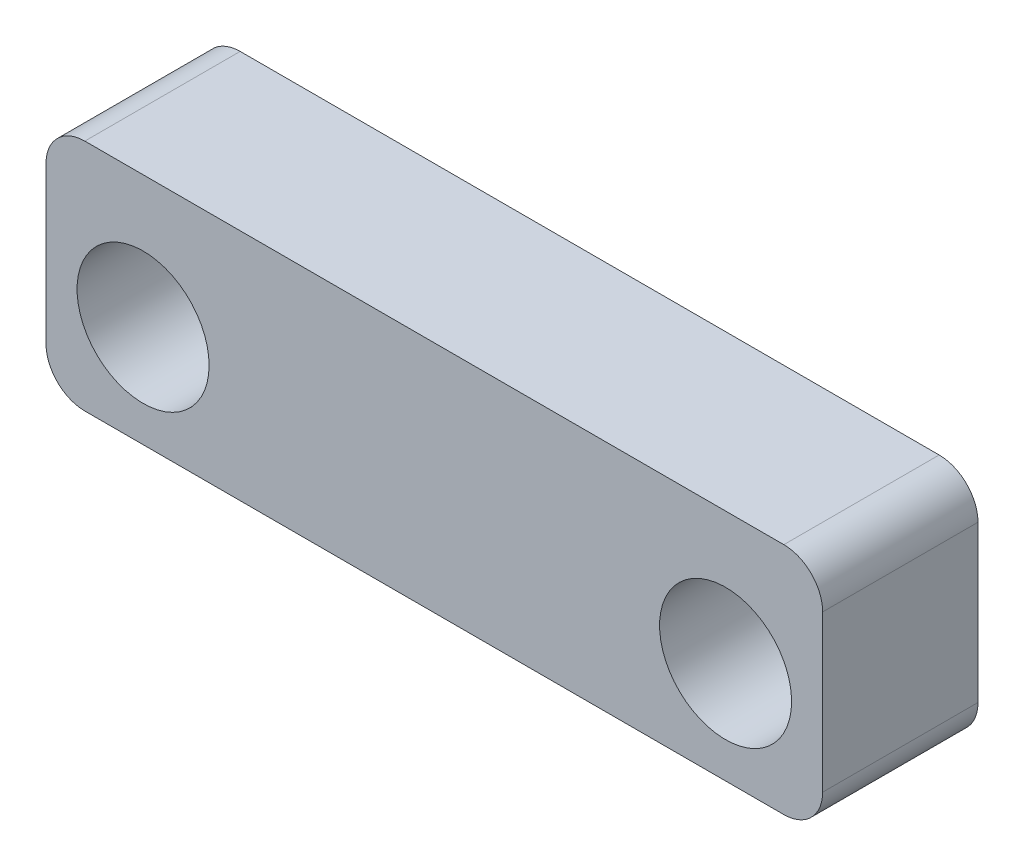
ISO-10303-21;
HEADER;
FILE_DESCRIPTION(('STEP AP214'),'2;1');
FILE_NAME('part.step','',(''),(''),'','','');
FILE_SCHEMA(('AUTOMOTIVE_DESIGN { 1 0 10303 214 1 1 1 1 }'));
ENDSEC;
DATA;
#1=APPLICATION_CONTEXT('core data for automotive mechanical design processes');
#2=APPLICATION_PROTOCOL_DEFINITION('international standard','automotive_design',2000,#1);
#3=PRODUCT_CONTEXT('',#1,'mechanical');
#4=PRODUCT('Part','Part','',(#3));
#5=PRODUCT_RELATED_PRODUCT_CATEGORY('part','',(#4));
#6=PRODUCT_DEFINITION_FORMATION('','',#4);
#7=PRODUCT_DEFINITION_CONTEXT('part definition',#1,'design');
#8=PRODUCT_DEFINITION('design','',#6,#7);
#9=PRODUCT_DEFINITION_SHAPE('','',#8);
#10=(LENGTH_UNIT() NAMED_UNIT(*) SI_UNIT(.MILLI.,.METRE.));
#11=(NAMED_UNIT(*) PLANE_ANGLE_UNIT() SI_UNIT($,.RADIAN.));
#12=(NAMED_UNIT(*) SI_UNIT($,.STERADIAN.) SOLID_ANGLE_UNIT());
#13=UNCERTAINTY_MEASURE_WITH_UNIT(LENGTH_MEASURE(1.E-05),#10,'distance_accuracy_value','');
#14=(GEOMETRIC_REPRESENTATION_CONTEXT(3) GLOBAL_UNCERTAINTY_ASSIGNED_CONTEXT((#13)) GLOBAL_UNIT_ASSIGNED_CONTEXT((#10,
#11,#12)) REPRESENTATION_CONTEXT('',''));
#15=CARTESIAN_POINT('',(0.,0.,0.));
#16=DIRECTION('',(0.,0.,1.));
#17=DIRECTION('',(1.,0.,0.));
#18=AXIS2_PLACEMENT_3D('',#15,#16,#17);
#19=CARTESIAN_POINT('',(-31.3276457282223,41.1785182435217,137.365661293432));
#20=DIRECTION('',(1.,0.,0.));
#21=DIRECTION('',(0.,0.,-1.));
#22=AXIS2_PLACEMENT_3D('',#19,#20,#21);
#23=PLANE('',#22);
#24=DIRECTION('',(0.,-1.,0.));
#25=VECTOR('',#24,1.);
#26=CARTESIAN_POINT('',(-31.3276457282223,41.1785182435217,133.365661293432));
#27=LINE('',#26,#25);
#28=CARTESIAN_POINT('',(-31.3276457282223,40.1785182435217,133.365661293432));
#29=VERTEX_POINT('',#28);
#30=CARTESIAN_POINT('',(-31.3276457282223,36.1582393508905,133.365661293432));
#31=VERTEX_POINT('',#30);
#32=EDGE_CURVE('E131',#29,#31,#27,.T.);
#33=ORIENTED_EDGE('',*,*,#32,.T.);
#34=DIRECTION('',(0.,0.,-1.));
#35=VECTOR('',#34,1.);
#36=CARTESIAN_POINT('',(-31.3276457282223,36.1582393508905,137.365661293432));
#37=LINE('',#36,#35);
#38=CARTESIAN_POINT('',(-31.3276457282223,36.1582393508905,137.365661293432));
#39=VERTEX_POINT('',#38);
#40=EDGE_CURVE('E11',#31,#39,#37,.F.);
#41=ORIENTED_EDGE('',*,*,#40,.T.);
#42=DIRECTION('',(0.,-1.,0.));
#43=VECTOR('',#42,1.);
#44=CARTESIAN_POINT('',(-31.3276457282223,41.1785182435217,137.365661293432));
#45=LINE('',#44,#43);
#46=CARTESIAN_POINT('',(-31.3276457282223,40.1785182435217,137.365661293432));
#47=VERTEX_POINT('',#46);
#48=EDGE_CURVE('E129',#47,#39,#45,.T.);
#49=ORIENTED_EDGE('',*,*,#48,.F.);
#50=DIRECTION('',(0.,0.,-1.));
#51=VECTOR('',#50,1.);
#52=CARTESIAN_POINT('',(-31.3276457282223,40.1785182435217,137.365661293432));
#53=LINE('',#52,#51);
#54=EDGE_CURVE('E42',#47,#29,#53,.T.);
#55=ORIENTED_EDGE('',*,*,#54,.T.);
#56=EDGE_LOOP('',(#33,#41,#49,#55));
#57=FACE_BOUND('',#56,.T.);
#58=ADVANCED_FACE('F33',(#57),#23,.F.);
#59=CARTESIAN_POINT('',(-31.3276457282223,35.1582393508905,137.365661293432));
#60=DIRECTION('',(0.,1.,0.));
#61=DIRECTION('',(0.,0.,1.));
#62=AXIS2_PLACEMENT_3D('',#59,#60,#61);
#63=PLANE('',#62);
#64=DIRECTION('',(1.,0.,0.));
#65=VECTOR('',#64,1.);
#66=CARTESIAN_POINT('',(-31.3276457282223,35.1582393508905,133.365661293432));
#67=LINE('',#66,#65);
#68=CARTESIAN_POINT('',(-30.3276457282223,35.1582393508905,133.365661293432));
#69=VERTEX_POINT('',#68);
#70=CARTESIAN_POINT('',(-12.3276457282223,35.1582393508905,133.365661293432));
#71=VERTEX_POINT('',#70);
#72=EDGE_CURVE('E127',#69,#71,#67,.T.);
#73=ORIENTED_EDGE('',*,*,#72,.T.);
#74=DIRECTION('',(0.,0.,-1.));
#75=VECTOR('',#74,1.);
#76=CARTESIAN_POINT('',(-12.3276457282223,35.1582393508905,137.365661293432));
#77=LINE('',#76,#75);
#78=CARTESIAN_POINT('',(-12.3276457282223,35.1582393508905,137.365661293432));
#79=VERTEX_POINT('',#78);
#80=EDGE_CURVE('E106',#71,#79,#77,.F.);
#81=ORIENTED_EDGE('',*,*,#80,.T.);
#82=DIRECTION('',(1.,0.,0.));
#83=VECTOR('',#82,1.);
#84=CARTESIAN_POINT('',(-31.3276457282223,35.1582393508905,137.365661293432));
#85=LINE('',#84,#83);
#86=CARTESIAN_POINT('',(-30.3276457282223,35.1582393508905,137.365661293432));
#87=VERTEX_POINT('',#86);
#88=EDGE_CURVE('E172',#87,#79,#85,.T.);
#89=ORIENTED_EDGE('',*,*,#88,.F.);
#90=DIRECTION('',(0.,0.,-1.));
#91=VECTOR('',#90,1.);
#92=CARTESIAN_POINT('',(-30.3276457282223,35.1582393508905,137.365661293432));
#93=LINE('',#92,#91);
#94=EDGE_CURVE('E111',#87,#69,#93,.T.);
#95=ORIENTED_EDGE('',*,*,#94,.T.);
#96=EDGE_LOOP('',(#73,#81,#89,#95));
#97=FACE_BOUND('',#96,.T.);
#98=ADVANCED_FACE('F191',(#97),#63,.F.);
#99=CARTESIAN_POINT('',(-11.3276457282223,41.1785182435217,137.365661293432));
#100=DIRECTION('',(-1.,0.,0.));
#101=DIRECTION('',(0.,0.,1.));
#102=AXIS2_PLACEMENT_3D('',#99,#100,#101);
#103=PLANE('',#102);
#104=DIRECTION('',(0.,1.,0.));
#105=VECTOR('',#104,1.);
#106=CARTESIAN_POINT('',(-11.3276457282223,41.1785182435217,137.365661293432));
#107=LINE('',#106,#105);
#108=CARTESIAN_POINT('',(-11.3276457282223,36.1582393508905,137.365661293432));
#109=VERTEX_POINT('',#108);
#110=CARTESIAN_POINT('',(-11.3276457282223,40.1785182435217,137.365661293432));
#111=VERTEX_POINT('',#110);
#112=EDGE_CURVE('E120',#109,#111,#107,.T.);
#113=ORIENTED_EDGE('',*,*,#112,.F.);
#114=DIRECTION('',(0.,0.,-1.));
#115=VECTOR('',#114,1.);
#116=CARTESIAN_POINT('',(-11.3276457282223,36.1582393508905,137.365661293432));
#117=LINE('',#116,#115);
#118=CARTESIAN_POINT('',(-11.3276457282223,36.1582393508905,133.365661293432));
#119=VERTEX_POINT('',#118);
#120=EDGE_CURVE('E105',#109,#119,#117,.T.);
#121=ORIENTED_EDGE('',*,*,#120,.T.);
#122=DIRECTION('',(0.,1.,0.));
#123=VECTOR('',#122,1.);
#124=CARTESIAN_POINT('',(-11.3276457282223,41.1785182435217,133.365661293432));
#125=LINE('',#124,#123);
#126=CARTESIAN_POINT('',(-11.3276457282223,40.1785182435217,133.365661293432));
#127=VERTEX_POINT('',#126);
#128=EDGE_CURVE('E118',#119,#127,#125,.T.);
#129=ORIENTED_EDGE('',*,*,#128,.T.);
#130=DIRECTION('',(0.,0.,-1.));
#131=VECTOR('',#130,1.);
#132=CARTESIAN_POINT('',(-11.3276457282223,40.1785182435217,137.365661293432));
#133=LINE('',#132,#131);
#134=EDGE_CURVE('E122',#127,#111,#133,.F.);
#135=ORIENTED_EDGE('',*,*,#134,.T.);
#136=EDGE_LOOP('',(#113,#121,#129,#135));
#137=FACE_BOUND('',#136,.T.);
#138=ADVANCED_FACE('F117',(#137),#103,.F.);
#139=CARTESIAN_POINT('',(-31.3276457282223,41.1785182435217,137.365661293432));
#140=DIRECTION('',(0.,-1.,0.));
#141=DIRECTION('',(0.,0.,-1.));
#142=AXIS2_PLACEMENT_3D('',#139,#140,#141);
#143=PLANE('',#142);
#144=DIRECTION('',(-1.,0.,0.));
#145=VECTOR('',#144,1.);
#146=CARTESIAN_POINT('',(-31.3276457282223,41.1785182435217,137.365661293432));
#147=LINE('',#146,#145);
#148=CARTESIAN_POINT('',(-12.3276457282223,41.1785182435217,137.365661293432));
#149=VERTEX_POINT('',#148);
#150=CARTESIAN_POINT('',(-30.3276457282223,41.1785182435217,137.365661293432));
#151=VERTEX_POINT('',#150);
#152=EDGE_CURVE('E135',#149,#151,#147,.T.);
#153=ORIENTED_EDGE('',*,*,#152,.F.);
#154=DIRECTION('',(0.,0.,-1.));
#155=VECTOR('',#154,1.);
#156=CARTESIAN_POINT('',(-12.3276457282223,41.1785182435217,137.365661293432));
#157=LINE('',#156,#155);
#158=CARTESIAN_POINT('',(-12.3276457282223,41.1785182435217,133.365661293432));
#159=VERTEX_POINT('',#158);
#160=EDGE_CURVE('E152',#149,#159,#157,.T.);
#161=ORIENTED_EDGE('',*,*,#160,.T.);
#162=DIRECTION('',(-1.,0.,0.));
#163=VECTOR('',#162,1.);
#164=CARTESIAN_POINT('',(-31.3276457282223,41.1785182435217,133.365661293432));
#165=LINE('',#164,#163);
#166=CARTESIAN_POINT('',(-30.3276457282223,41.1785182435217,133.365661293432));
#167=VERTEX_POINT('',#166);
#168=EDGE_CURVE('E126',#159,#167,#165,.T.);
#169=ORIENTED_EDGE('',*,*,#168,.T.);
#170=DIRECTION('',(0.,0.,-1.));
#171=VECTOR('',#170,1.);
#172=CARTESIAN_POINT('',(-30.3276457282223,41.1785182435217,137.365661293432));
#173=LINE('',#172,#171);
#174=EDGE_CURVE('E50',#167,#151,#173,.F.);
#175=ORIENTED_EDGE('',*,*,#174,.T.);
#176=EDGE_LOOP('',(#153,#161,#169,#175));
#177=FACE_BOUND('',#176,.T.);
#178=ADVANCED_FACE('F194',(#177),#143,.F.);
#179=CARTESIAN_POINT('',(0.,0.,137.365661293432));
#180=DIRECTION('',(0.,0.,1.));
#181=DIRECTION('',(1.,0.,0.));
#182=AXIS2_PLACEMENT_3D('',#179,#180,#181);
#183=PLANE('',#182);
#184=CARTESIAN_POINT('',(-28.8276457282225,37.7785182435216,137.365661293432));
#185=DIRECTION('',(0.,0.,1.));
#186=DIRECTION('',(1.,0.,0.));
#187=AXIS2_PLACEMENT_3D('',#184,#185,#186);
#188=CIRCLE('',#187,1.7);
#189=CARTESIAN_POINT('',(-27.1276457282225,37.7785182435216,137.365661293432));
#190=VERTEX_POINT('',#189);
#191=EDGE_CURVE('E167',#190,#190,#188,.T.);
#192=ORIENTED_EDGE('',*,*,#191,.F.);
#193=EDGE_LOOP('',(#192));
#194=FACE_BOUND('',#193,.T.);
#195=CARTESIAN_POINT('',(-13.8276457282225,37.7785182435217,137.365661293432));
#196=DIRECTION('',(0.,0.,1.));
#197=DIRECTION('',(1.,0.,0.));
#198=AXIS2_PLACEMENT_3D('',#195,#196,#197);
#199=CIRCLE('',#198,1.7);
#200=CARTESIAN_POINT('',(-12.1276457282225,37.7785182435217,137.365661293432));
#201=VERTEX_POINT('',#200);
#202=EDGE_CURVE('E158',#201,#201,#199,.T.);
#203=ORIENTED_EDGE('',*,*,#202,.F.);
#204=EDGE_LOOP('',(#203));
#205=FACE_BOUND('',#204,.T.);
#206=ORIENTED_EDGE('',*,*,#88,.T.);
#207=CARTESIAN_POINT('',(-12.3276457282223,36.1582393508905,137.365661293432));
#208=DIRECTION('',(0.,0.,1.));
#209=DIRECTION('',(1.,0.,0.));
#210=AXIS2_PLACEMENT_3D('',#207,#208,#209);
#211=CIRCLE('',#210,1.);
#212=EDGE_CURVE('E149',#79,#109,#211,.T.);
#213=ORIENTED_EDGE('',*,*,#212,.T.);
#214=ORIENTED_EDGE('',*,*,#112,.T.);
#215=CARTESIAN_POINT('',(-12.3276457282223,40.1785182435217,137.365661293432));
#216=DIRECTION('',(0.,0.,1.));
#217=DIRECTION('',(1.,0.,0.));
#218=AXIS2_PLACEMENT_3D('',#215,#216,#217);
#219=CIRCLE('',#218,1.);
#220=EDGE_CURVE('E57',#111,#149,#219,.T.);
#221=ORIENTED_EDGE('',*,*,#220,.T.);
#222=ORIENTED_EDGE('',*,*,#152,.T.);
#223=CARTESIAN_POINT('',(-30.3276457282223,40.1785182435217,137.365661293432));
#224=DIRECTION('',(0.,0.,1.));
#225=DIRECTION('',(1.,0.,0.));
#226=AXIS2_PLACEMENT_3D('',#223,#224,#225);
#227=CIRCLE('',#226,1.);
#228=EDGE_CURVE('E144',#151,#47,#227,.T.);
#229=ORIENTED_EDGE('',*,*,#228,.T.);
#230=ORIENTED_EDGE('',*,*,#48,.T.);
#231=CARTESIAN_POINT('',(-30.3276457282223,36.1582393508905,137.365661293432));
#232=DIRECTION('',(0.,0.,1.));
#233=DIRECTION('',(1.,0.,0.));
#234=AXIS2_PLACEMENT_3D('',#231,#232,#233);
#235=CIRCLE('',#234,1.);
#236=EDGE_CURVE('E146',#39,#87,#235,.T.);
#237=ORIENTED_EDGE('',*,*,#236,.T.);
#238=EDGE_LOOP('',(#206,#213,#214,#221,#222,#229,#230,#237));
#239=FACE_BOUND('',#238,.T.);
#240=ADVANCED_FACE('F177',(#194,#205,#239),#183,.T.);
#241=CARTESIAN_POINT('',(0.,0.,133.365661293432));
#242=DIRECTION('',(0.,0.,1.));
#243=DIRECTION('',(1.,0.,0.));
#244=AXIS2_PLACEMENT_3D('',#241,#242,#243);
#245=PLANE('',#244);
#246=CARTESIAN_POINT('',(-28.8276457282225,37.7785182435216,133.365661293432));
#247=DIRECTION('',(0.,0.,1.));
#248=DIRECTION('',(1.,0.,0.));
#249=AXIS2_PLACEMENT_3D('',#246,#247,#248);
#250=CIRCLE('',#249,1.7);
#251=CARTESIAN_POINT('',(-27.1276457282225,37.7785182435216,133.365661293432));
#252=VERTEX_POINT('',#251);
#253=EDGE_CURVE('E37',#252,#252,#250,.T.);
#254=ORIENTED_EDGE('',*,*,#253,.T.);
#255=EDGE_LOOP('',(#254));
#256=FACE_BOUND('',#255,.T.);
#257=CARTESIAN_POINT('',(-13.8276457282225,37.7785182435217,133.365661293432));
#258=DIRECTION('',(0.,0.,1.));
#259=DIRECTION('',(1.,0.,0.));
#260=AXIS2_PLACEMENT_3D('',#257,#258,#259);
#261=CIRCLE('',#260,1.7);
#262=CARTESIAN_POINT('',(-12.1276457282225,37.7785182435217,133.365661293432));
#263=VERTEX_POINT('',#262);
#264=EDGE_CURVE('E156',#263,#263,#261,.T.);
#265=ORIENTED_EDGE('',*,*,#264,.T.);
#266=EDGE_LOOP('',(#265));
#267=FACE_BOUND('',#266,.T.);
#268=ORIENTED_EDGE('',*,*,#128,.F.);
#269=CARTESIAN_POINT('',(-12.3276457282223,36.1582393508905,133.365661293432));
#270=DIRECTION('',(0.,0.,1.));
#271=DIRECTION('',(1.,0.,0.));
#272=AXIS2_PLACEMENT_3D('',#269,#270,#271);
#273=CIRCLE('',#272,1.);
#274=EDGE_CURVE('E101',#119,#71,#273,.F.);
#275=ORIENTED_EDGE('',*,*,#274,.T.);
#276=ORIENTED_EDGE('',*,*,#72,.F.);
#277=CARTESIAN_POINT('',(-30.3276457282223,36.1582393508905,133.365661293432));
#278=DIRECTION('',(0.,0.,1.));
#279=DIRECTION('',(1.,0.,0.));
#280=AXIS2_PLACEMENT_3D('',#277,#278,#279);
#281=CIRCLE('',#280,1.);
#282=EDGE_CURVE('E138',#69,#31,#281,.F.);
#283=ORIENTED_EDGE('',*,*,#282,.T.);
#284=ORIENTED_EDGE('',*,*,#32,.F.);
#285=CARTESIAN_POINT('',(-30.3276457282223,40.1785182435217,133.365661293432));
#286=DIRECTION('',(0.,0.,1.));
#287=DIRECTION('',(1.,0.,0.));
#288=AXIS2_PLACEMENT_3D('',#285,#286,#287);
#289=CIRCLE('',#288,1.);
#290=EDGE_CURVE('E121',#29,#167,#289,.F.);
#291=ORIENTED_EDGE('',*,*,#290,.T.);
#292=ORIENTED_EDGE('',*,*,#168,.F.);
#293=CARTESIAN_POINT('',(-12.3276457282223,40.1785182435217,133.365661293432));
#294=DIRECTION('',(0.,0.,1.));
#295=DIRECTION('',(1.,0.,0.));
#296=AXIS2_PLACEMENT_3D('',#293,#294,#295);
#297=CIRCLE('',#296,1.);
#298=EDGE_CURVE('E112',#159,#127,#297,.F.);
#299=ORIENTED_EDGE('',*,*,#298,.T.);
#300=EDGE_LOOP('',(#268,#275,#276,#283,#284,#291,#292,#299));
#301=FACE_BOUND('',#300,.T.);
#302=ADVANCED_FACE('F124',(#256,#267,#301),#245,.F.);
#303=CARTESIAN_POINT('',(-12.3276457282223,36.1582393508905,137.365661293432));
#304=DIRECTION('',(0.,0.,-1.));
#305=DIRECTION('',(-1.,0.,0.));
#306=AXIS2_PLACEMENT_3D('',#303,#304,#305);
#307=CYLINDRICAL_SURFACE('',#306,1.);
#308=ORIENTED_EDGE('',*,*,#212,.F.);
#309=ORIENTED_EDGE('',*,*,#80,.F.);
#310=ORIENTED_EDGE('',*,*,#274,.F.);
#311=ORIENTED_EDGE('',*,*,#120,.F.);
#312=EDGE_LOOP('',(#308,#309,#310,#311));
#313=FACE_BOUND('',#312,.T.);
#314=ADVANCED_FACE('F104',(#313),#307,.T.);
#315=CARTESIAN_POINT('',(-12.3276457282223,40.1785182435217,137.365661293432));
#316=DIRECTION('',(0.,0.,-1.));
#317=DIRECTION('',(-1.,0.,0.));
#318=AXIS2_PLACEMENT_3D('',#315,#316,#317);
#319=CYLINDRICAL_SURFACE('',#318,1.);
#320=ORIENTED_EDGE('',*,*,#220,.F.);
#321=ORIENTED_EDGE('',*,*,#134,.F.);
#322=ORIENTED_EDGE('',*,*,#298,.F.);
#323=ORIENTED_EDGE('',*,*,#160,.F.);
#324=EDGE_LOOP('',(#320,#321,#322,#323));
#325=FACE_BOUND('',#324,.T.);
#326=ADVANCED_FACE('F193',(#325),#319,.T.);
#327=CARTESIAN_POINT('',(-30.3276457282223,36.1582393508905,137.365661293432));
#328=DIRECTION('',(0.,0.,-1.));
#329=DIRECTION('',(-1.,0.,0.));
#330=AXIS2_PLACEMENT_3D('',#327,#328,#329);
#331=CYLINDRICAL_SURFACE('',#330,1.);
#332=ORIENTED_EDGE('',*,*,#236,.F.);
#333=ORIENTED_EDGE('',*,*,#40,.F.);
#334=ORIENTED_EDGE('',*,*,#282,.F.);
#335=ORIENTED_EDGE('',*,*,#94,.F.);
#336=EDGE_LOOP('',(#332,#333,#334,#335));
#337=FACE_BOUND('',#336,.T.);
#338=ADVANCED_FACE('F188',(#337),#331,.T.);
#339=CARTESIAN_POINT('',(-30.3276457282223,40.1785182435217,137.365661293432));
#340=DIRECTION('',(0.,0.,-1.));
#341=DIRECTION('',(-1.,0.,0.));
#342=AXIS2_PLACEMENT_3D('',#339,#340,#341);
#343=CYLINDRICAL_SURFACE('',#342,1.);
#344=ORIENTED_EDGE('',*,*,#228,.F.);
#345=ORIENTED_EDGE('',*,*,#174,.F.);
#346=ORIENTED_EDGE('',*,*,#290,.F.);
#347=ORIENTED_EDGE('',*,*,#54,.F.);
#348=EDGE_LOOP('',(#344,#345,#346,#347));
#349=FACE_BOUND('',#348,.T.);
#350=ADVANCED_FACE('F35',(#349),#343,.T.);
#351=CARTESIAN_POINT('',(-13.8276457282225,37.7785182435217,137.365661293432));
#352=DIRECTION('',(0.,0.,1.));
#353=DIRECTION('',(1.,0.,0.));
#354=AXIS2_PLACEMENT_3D('',#351,#352,#353);
#355=CYLINDRICAL_SURFACE('',#354,1.7);
#356=ORIENTED_EDGE('',*,*,#202,.T.);
#357=EDGE_LOOP('',(#356));
#358=FACE_BOUND('',#357,.T.);
#359=ORIENTED_EDGE('',*,*,#264,.F.);
#360=EDGE_LOOP('',(#359));
#361=FACE_BOUND('',#360,.T.);
#362=ADVANCED_FACE('F219',(#358,#361),#355,.F.);
#363=CARTESIAN_POINT('',(-28.8276457282225,37.7785182435216,137.365661293432));
#364=DIRECTION('',(0.,0.,1.));
#365=DIRECTION('',(1.,0.,0.));
#366=AXIS2_PLACEMENT_3D('',#363,#364,#365);
#367=CYLINDRICAL_SURFACE('',#366,1.7);
#368=ORIENTED_EDGE('',*,*,#191,.T.);
#369=EDGE_LOOP('',(#368));
#370=FACE_BOUND('',#369,.T.);
#371=ORIENTED_EDGE('',*,*,#253,.F.);
#372=EDGE_LOOP('',(#371));
#373=FACE_BOUND('',#372,.T.);
#374=ADVANCED_FACE('F223',(#370,#373),#367,.F.);
#375=CLOSED_SHELL('',(#58,#98,#138,#178,#240,#302,#314,#326,#338,#350,#362,#374));
#376=MANIFOLD_SOLID_BREP('B2',#375);
#377=ADVANCED_BREP_SHAPE_REPRESENTATION('',(#18,#376),#14);
#378=SHAPE_DEFINITION_REPRESENTATION(#9,#377);
ENDSEC;
END-ISO-10303-21;
